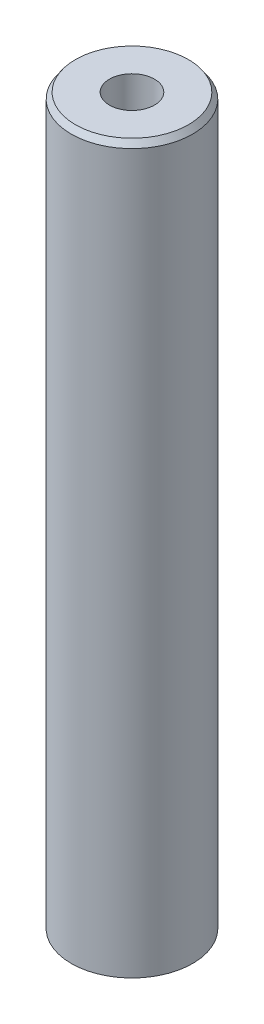
ISO-10303-21;
HEADER;
FILE_DESCRIPTION(('STEP AP214'),'2;1');
FILE_NAME('part.step','',(''),(''),'','','');
FILE_SCHEMA(('AUTOMOTIVE_DESIGN { 1 0 10303 214 1 1 1 1 }'));
ENDSEC;
DATA;
#1=APPLICATION_CONTEXT('core data for automotive mechanical design processes');
#2=APPLICATION_PROTOCOL_DEFINITION('international standard','automotive_design',2000,#1);
#3=PRODUCT_CONTEXT('',#1,'mechanical');
#4=PRODUCT('Part','Part','',(#3));
#5=PRODUCT_RELATED_PRODUCT_CATEGORY('part','',(#4));
#6=PRODUCT_DEFINITION_FORMATION('','',#4);
#7=PRODUCT_DEFINITION_CONTEXT('part definition',#1,'design');
#8=PRODUCT_DEFINITION('design','',#6,#7);
#9=PRODUCT_DEFINITION_SHAPE('','',#8);
#10=(LENGTH_UNIT() NAMED_UNIT(*) SI_UNIT(.MILLI.,.METRE.));
#11=(NAMED_UNIT(*) PLANE_ANGLE_UNIT() SI_UNIT($,.RADIAN.));
#12=(NAMED_UNIT(*) SI_UNIT($,.STERADIAN.) SOLID_ANGLE_UNIT());
#13=UNCERTAINTY_MEASURE_WITH_UNIT(LENGTH_MEASURE(1.E-05),#10,'distance_accuracy_value','');
#14=(GEOMETRIC_REPRESENTATION_CONTEXT(3) GLOBAL_UNCERTAINTY_ASSIGNED_CONTEXT((#13)) GLOBAL_UNIT_ASSIGNED_CONTEXT((#10,
#11,#12)) REPRESENTATION_CONTEXT('',''));
#15=CARTESIAN_POINT('',(0.,0.,0.));
#16=DIRECTION('',(0.,0.,1.));
#17=DIRECTION('',(1.,0.,0.));
#18=AXIS2_PLACEMENT_3D('',#15,#16,#17);
#19=CARTESIAN_POINT('',(0.,600.,0.));
#20=DIRECTION('',(0.,-1.,0.));
#21=DIRECTION('',(0.,0.,-1.));
#22=AXIS2_PLACEMENT_3D('',#19,#20,#21);
#23=CYLINDRICAL_SURFACE('',#22,50.);
#24=CARTESIAN_POINT('',(0.,595.038766150846,0.));
#25=DIRECTION('',(0.,1.,0.));
#26=DIRECTION('',(0.,0.,1.));
#27=AXIS2_PLACEMENT_3D('',#24,#25,#26);
#28=CIRCLE('',#27,50.);
#29=CARTESIAN_POINT('',(0.,595.038766150846,50.));
#30=VERTEX_POINT('',#29);
#31=EDGE_CURVE('E50',#30,#30,#28,.F.);
#32=ORIENTED_EDGE('',*,*,#31,.T.);
#33=EDGE_LOOP('',(#32));
#34=FACE_BOUND('',#33,.T.);
#35=CARTESIAN_POINT('',(0.,3.46922974470154,0.));
#36=DIRECTION('',(0.,1.,0.));
#37=DIRECTION('',(0.,0.,1.));
#38=AXIS2_PLACEMENT_3D('',#35,#36,#37);
#39=CIRCLE('',#38,50.);
#40=CARTESIAN_POINT('',(0.,3.46922974470154,50.));
#41=VERTEX_POINT('',#40);
#42=EDGE_CURVE('E51',#41,#41,#39,.T.);
#43=ORIENTED_EDGE('',*,*,#42,.T.);
#44=EDGE_LOOP('',(#43));
#45=FACE_BOUND('',#44,.T.);
#46=ADVANCED_FACE('F39',(#34,#45),#23,.T.);
#47=CARTESIAN_POINT('',(0.,600.,0.));
#48=DIRECTION('',(0.,1.,0.));
#49=DIRECTION('',(0.,0.,1.));
#50=AXIS2_PLACEMENT_3D('',#47,#48,#49);
#51=PLANE('',#50);
#52=CARTESIAN_POINT('',(0.,600.,0.));
#53=DIRECTION('',(0.,1.,0.));
#54=DIRECTION('',(0.,0.,1.));
#55=AXIS2_PLACEMENT_3D('',#52,#53,#54);
#56=CIRCLE('',#55,46.5307702552984);
#57=CARTESIAN_POINT('',(0.,600.,46.5307702552984));
#58=VERTEX_POINT('',#57);
#59=EDGE_CURVE('E54',#58,#58,#56,.T.);
#60=ORIENTED_EDGE('',*,*,#59,.T.);
#61=EDGE_LOOP('',(#60));
#62=FACE_BOUND('',#61,.T.);
#63=CARTESIAN_POINT('',(0.,600.,0.));
#64=DIRECTION('',(0.,1.,0.));
#65=DIRECTION('',(0.,0.,1.));
#66=AXIS2_PLACEMENT_3D('',#63,#64,#65);
#67=CIRCLE('',#66,18.552716964967);
#68=CARTESIAN_POINT('',(0.,600.,18.552716964967));
#69=VERTEX_POINT('',#68);
#70=EDGE_CURVE('E58',#69,#69,#67,.T.);
#71=ORIENTED_EDGE('',*,*,#70,.F.);
#72=EDGE_LOOP('',(#71));
#73=FACE_BOUND('',#72,.T.);
#74=ADVANCED_FACE('F69',(#62,#73),#51,.T.);
#75=CARTESIAN_POINT('',(0.,0.,0.));
#76=DIRECTION('',(0.,1.,0.));
#77=DIRECTION('',(0.,0.,1.));
#78=AXIS2_PLACEMENT_3D('',#75,#76,#77);
#79=PLANE('',#78);
#80=CARTESIAN_POINT('',(0.,0.,0.));
#81=DIRECTION('',(0.,1.,0.));
#82=DIRECTION('',(0.,0.,1.));
#83=AXIS2_PLACEMENT_3D('',#80,#81,#82);
#84=CIRCLE('',#83,45.0387661508462);
#85=CARTESIAN_POINT('',(0.,0.,45.0387661508462));
#86=VERTEX_POINT('',#85);
#87=EDGE_CURVE('E10',#86,#86,#84,.F.);
#88=ORIENTED_EDGE('',*,*,#87,.T.);
#89=EDGE_LOOP('',(#88));
#90=FACE_BOUND('',#89,.T.);
#91=CARTESIAN_POINT('',(0.,0.,0.));
#92=DIRECTION('',(0.,1.,0.));
#93=DIRECTION('',(0.,0.,1.));
#94=AXIS2_PLACEMENT_3D('',#91,#92,#93);
#95=CIRCLE('',#94,18.552716964967);
#96=CARTESIAN_POINT('',(0.,0.,18.552716964967));
#97=VERTEX_POINT('',#96);
#98=EDGE_CURVE('E63',#97,#97,#95,.T.);
#99=ORIENTED_EDGE('',*,*,#98,.T.);
#100=EDGE_LOOP('',(#99));
#101=FACE_BOUND('',#100,.T.);
#102=ADVANCED_FACE('F75',(#90,#101),#79,.F.);
#103=CARTESIAN_POINT('',(0.,600.,0.));
#104=DIRECTION('',(0.,-1.,0.));
#105=DIRECTION('',(0.,0.,-1.));
#106=AXIS2_PLACEMENT_3D('',#103,#104,#105);
#107=CYLINDRICAL_SURFACE('',#106,18.552716964967);
#108=ORIENTED_EDGE('',*,*,#70,.T.);
#109=EDGE_LOOP('',(#108));
#110=FACE_BOUND('',#109,.T.);
#111=ORIENTED_EDGE('',*,*,#98,.F.);
#112=EDGE_LOOP('',(#111));
#113=FACE_BOUND('',#112,.T.);
#114=ADVANCED_FACE('F70',(#110,#113),#107,.F.);
#115=CARTESIAN_POINT('',(0.,600.,0.));
#116=DIRECTION('',(0.,-1.,0.));
#117=DIRECTION('',(0.,0.,-1.));
#118=AXIS2_PLACEMENT_3D('',#115,#116,#117);
#119=CONICAL_SURFACE('',#118,46.5307702552984,0.610234205314545);
#120=ORIENTED_EDGE('',*,*,#31,.F.);
#121=EDGE_LOOP('',(#120));
#122=FACE_BOUND('',#121,.T.);
#123=ORIENTED_EDGE('',*,*,#59,.F.);
#124=EDGE_LOOP('',(#123));
#125=FACE_BOUND('',#124,.T.);
#126=ADVANCED_FACE('F81',(#122,#125),#119,.T.);
#127=CARTESIAN_POINT('',(0.,3.46922974470154,0.));
#128=DIRECTION('',(0.,1.,0.));
#129=DIRECTION('',(0.,0.,1.));
#130=AXIS2_PLACEMENT_3D('',#127,#128,#129);
#131=CONICAL_SURFACE('',#130,50.,0.96056212148035);
#132=ORIENTED_EDGE('',*,*,#87,.F.);
#133=EDGE_LOOP('',(#132));
#134=FACE_BOUND('',#133,.T.);
#135=ORIENTED_EDGE('',*,*,#42,.F.);
#136=EDGE_LOOP('',(#135));
#137=FACE_BOUND('',#136,.T.);
#138=ADVANCED_FACE('F45',(#134,#137),#131,.T.);
#139=CLOSED_SHELL('',(#46,#74,#102,#114,#126,#138));
#140=MANIFOLD_SOLID_BREP('B2',#139);
#141=ADVANCED_BREP_SHAPE_REPRESENTATION('',(#18,#140),#14);
#142=SHAPE_DEFINITION_REPRESENTATION(#9,#141);
ENDSEC;
END-ISO-10303-21;
